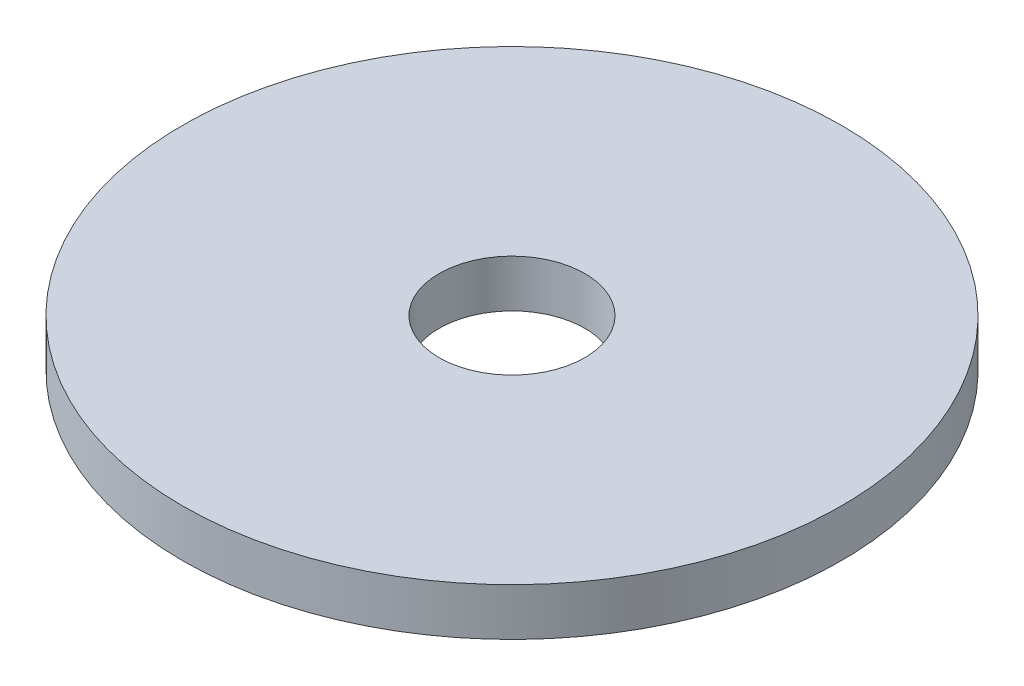
ISO-10303-21;
HEADER;
FILE_DESCRIPTION(('STEP AP214'),'2;1');
FILE_NAME('part.step','',(''),(''),'','','');
FILE_SCHEMA(('AUTOMOTIVE_DESIGN { 1 0 10303 214 1 1 1 1 }'));
ENDSEC;
DATA;
#1=APPLICATION_CONTEXT('core data for automotive mechanical design processes');
#2=APPLICATION_PROTOCOL_DEFINITION('international standard','automotive_design',2000,#1);
#3=PRODUCT_CONTEXT('',#1,'mechanical');
#4=PRODUCT('Part','Part','',(#3));
#5=PRODUCT_RELATED_PRODUCT_CATEGORY('part','',(#4));
#6=PRODUCT_DEFINITION_FORMATION('','',#4);
#7=PRODUCT_DEFINITION_CONTEXT('part definition',#1,'design');
#8=PRODUCT_DEFINITION('design','',#6,#7);
#9=PRODUCT_DEFINITION_SHAPE('','',#8);
#10=(LENGTH_UNIT() NAMED_UNIT(*) SI_UNIT(.MILLI.,.METRE.));
#11=(NAMED_UNIT(*) PLANE_ANGLE_UNIT() SI_UNIT($,.RADIAN.));
#12=(NAMED_UNIT(*) SI_UNIT($,.STERADIAN.) SOLID_ANGLE_UNIT());
#13=UNCERTAINTY_MEASURE_WITH_UNIT(LENGTH_MEASURE(1.E-05),#10,'distance_accuracy_value','');
#14=(GEOMETRIC_REPRESENTATION_CONTEXT(3) GLOBAL_UNCERTAINTY_ASSIGNED_CONTEXT((#13)) GLOBAL_UNIT_ASSIGNED_CONTEXT((#10,
#11,#12)) REPRESENTATION_CONTEXT('',''));
#15=CARTESIAN_POINT('',(0.,0.,0.));
#16=DIRECTION('',(0.,0.,1.));
#17=DIRECTION('',(1.,0.,0.));
#18=AXIS2_PLACEMENT_3D('',#15,#16,#17);
#19=CARTESIAN_POINT('',(0.,1.6002,0.));
#20=DIRECTION('',(0.,1.,0.));
#21=DIRECTION('',(0.,0.,1.));
#22=AXIS2_PLACEMENT_3D('',#19,#20,#21);
#23=PLANE('',#22);
#24=CARTESIAN_POINT('',(0.,1.6002,0.));
#25=DIRECTION('',(0.,1.,0.));
#26=DIRECTION('',(0.,0.,1.));
#27=AXIS2_PLACEMENT_3D('',#24,#25,#26);
#28=CIRCLE('',#27,11.1125);
#29=CARTESIAN_POINT('',(0.,1.6002,11.1125));
#30=VERTEX_POINT('',#29);
#31=EDGE_CURVE('E10',#30,#30,#28,.T.);
#32=ORIENTED_EDGE('',*,*,#31,.T.);
#33=EDGE_LOOP('',(#32));
#34=FACE_BOUND('',#33,.T.);
#35=CARTESIAN_POINT('',(0.,1.6002,0.));
#36=DIRECTION('',(0.,1.,0.));
#37=DIRECTION('',(0.,0.,1.));
#38=AXIS2_PLACEMENT_3D('',#35,#36,#37);
#39=CIRCLE('',#38,2.45745);
#40=CARTESIAN_POINT('',(0.,1.6002,2.45745));
#41=VERTEX_POINT('',#40);
#42=EDGE_CURVE('E41',#41,#41,#39,.T.);
#43=ORIENTED_EDGE('',*,*,#42,.F.);
#44=EDGE_LOOP('',(#43));
#45=FACE_BOUND('',#44,.T.);
#46=ADVANCED_FACE('F30',(#34,#45),#23,.T.);
#47=CARTESIAN_POINT('',(0.,0.,0.));
#48=DIRECTION('',(0.,1.,0.));
#49=DIRECTION('',(0.,0.,1.));
#50=AXIS2_PLACEMENT_3D('',#47,#48,#49);
#51=PLANE('',#50);
#52=CARTESIAN_POINT('',(0.,0.,0.));
#53=DIRECTION('',(0.,1.,0.));
#54=DIRECTION('',(0.,0.,1.));
#55=AXIS2_PLACEMENT_3D('',#52,#53,#54);
#56=CIRCLE('',#55,11.1125);
#57=CARTESIAN_POINT('',(0.,0.,11.1125));
#58=VERTEX_POINT('',#57);
#59=EDGE_CURVE('E34',#58,#58,#56,.T.);
#60=ORIENTED_EDGE('',*,*,#59,.F.);
#61=EDGE_LOOP('',(#60));
#62=FACE_BOUND('',#61,.T.);
#63=CARTESIAN_POINT('',(0.,0.,0.));
#64=DIRECTION('',(0.,1.,0.));
#65=DIRECTION('',(0.,0.,1.));
#66=AXIS2_PLACEMENT_3D('',#63,#64,#65);
#67=CIRCLE('',#66,2.45745);
#68=CARTESIAN_POINT('',(0.,0.,2.45745));
#69=VERTEX_POINT('',#68);
#70=EDGE_CURVE('E43',#69,#69,#67,.T.);
#71=ORIENTED_EDGE('',*,*,#70,.T.);
#72=EDGE_LOOP('',(#71));
#73=FACE_BOUND('',#72,.T.);
#74=ADVANCED_FACE('F53',(#62,#73),#51,.F.);
#75=CARTESIAN_POINT('',(0.,1.6002,0.));
#76=DIRECTION('',(0.,-1.,0.));
#77=DIRECTION('',(0.,0.,-1.));
#78=AXIS2_PLACEMENT_3D('',#75,#76,#77);
#79=CYLINDRICAL_SURFACE('',#78,11.1125);
#80=ORIENTED_EDGE('',*,*,#31,.F.);
#81=EDGE_LOOP('',(#80));
#82=FACE_BOUND('',#81,.T.);
#83=ORIENTED_EDGE('',*,*,#59,.T.);
#84=EDGE_LOOP('',(#83));
#85=FACE_BOUND('',#84,.T.);
#86=ADVANCED_FACE('F32',(#82,#85),#79,.T.);
#87=CARTESIAN_POINT('',(0.,1.6002,0.));
#88=DIRECTION('',(0.,-1.,0.));
#89=DIRECTION('',(0.,0.,-1.));
#90=AXIS2_PLACEMENT_3D('',#87,#88,#89);
#91=CYLINDRICAL_SURFACE('',#90,2.45745);
#92=ORIENTED_EDGE('',*,*,#42,.T.);
#93=EDGE_LOOP('',(#92));
#94=FACE_BOUND('',#93,.T.);
#95=ORIENTED_EDGE('',*,*,#70,.F.);
#96=EDGE_LOOP('',(#95));
#97=FACE_BOUND('',#96,.T.);
#98=ADVANCED_FACE('F49',(#94,#97),#91,.F.);
#99=CLOSED_SHELL('',(#46,#74,#86,#98));
#100=MANIFOLD_SOLID_BREP('B2',#99);
#101=ADVANCED_BREP_SHAPE_REPRESENTATION('',(#18,#100),#14);
#102=SHAPE_DEFINITION_REPRESENTATION(#9,#101);
ENDSEC;
END-ISO-10303-21;
